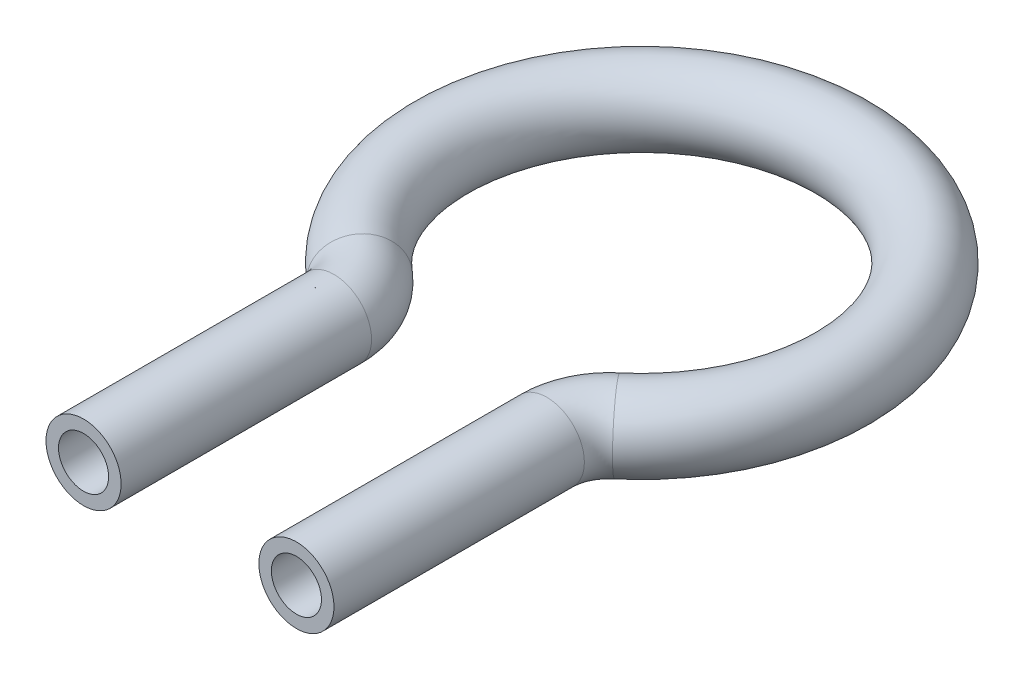
ISO-10303-21;
HEADER;
FILE_DESCRIPTION(('STEP AP214'),'2;1');
FILE_NAME('part.step','',(''),(''),'','','');
FILE_SCHEMA(('AUTOMOTIVE_DESIGN { 1 0 10303 214 1 1 1 1 }'));
ENDSEC;
DATA;
#1=APPLICATION_CONTEXT('core data for automotive mechanical design processes');
#2=APPLICATION_PROTOCOL_DEFINITION('international standard','automotive_design',2000,#1);
#3=PRODUCT_CONTEXT('',#1,'mechanical');
#4=PRODUCT('Part','Part','',(#3));
#5=PRODUCT_RELATED_PRODUCT_CATEGORY('part','',(#4));
#6=PRODUCT_DEFINITION_FORMATION('','',#4);
#7=PRODUCT_DEFINITION_CONTEXT('part definition',#1,'design');
#8=PRODUCT_DEFINITION('design','',#6,#7);
#9=PRODUCT_DEFINITION_SHAPE('','',#8);
#10=(LENGTH_UNIT() NAMED_UNIT(*) SI_UNIT(.MILLI.,.METRE.));
#11=(NAMED_UNIT(*) PLANE_ANGLE_UNIT() SI_UNIT($,.RADIAN.));
#12=(NAMED_UNIT(*) SI_UNIT($,.STERADIAN.) SOLID_ANGLE_UNIT());
#13=UNCERTAINTY_MEASURE_WITH_UNIT(LENGTH_MEASURE(1.E-05),#10,'distance_accuracy_value','');
#14=(GEOMETRIC_REPRESENTATION_CONTEXT(3) GLOBAL_UNCERTAINTY_ASSIGNED_CONTEXT((#13)) GLOBAL_UNIT_ASSIGNED_CONTEXT((#10,
#11,#12)) REPRESENTATION_CONTEXT('',''));
#15=CARTESIAN_POINT('',(0.,0.,0.));
#16=DIRECTION('',(0.,0.,1.));
#17=DIRECTION('',(1.,0.,0.));
#18=AXIS2_PLACEMENT_3D('',#15,#16,#17);
#19=CARTESIAN_POINT('',(-8.5,0.,36.0857079421454));
#20=DIRECTION('',(0.,0.,-1.));
#21=DIRECTION('',(-1.,0.,0.));
#22=AXIS2_PLACEMENT_3D('',#19,#20,#21);
#23=CYLINDRICAL_SURFACE('',#22,3.);
#24=CARTESIAN_POINT('',(-8.5,0.,16.0857079421454));
#25=DIRECTION('',(0.,0.,-1.));
#26=DIRECTION('',(-1.,0.,0.));
#27=AXIS2_PLACEMENT_3D('',#24,#25,#26);
#28=CIRCLE('',#27,3.);
#29=CARTESIAN_POINT('',(-5.5,0.,16.0857079421454));
#30=VERTEX_POINT('',#29);
#31=EDGE_CURVE('E65',#30,#30,#28,.T.);
#32=ORIENTED_EDGE('',*,*,#31,.F.);
#33=EDGE_LOOP('',(#32));
#34=FACE_BOUND('',#33,.T.);
#35=CARTESIAN_POINT('',(-8.5,0.,36.0857079421454));
#36=DIRECTION('',(0.,0.,-1.));
#37=DIRECTION('',(-1.,0.,0.));
#38=AXIS2_PLACEMENT_3D('',#35,#36,#37);
#39=CIRCLE('',#38,3.);
#40=CARTESIAN_POINT('',(-11.5,0.,36.0857079421454));
#41=VERTEX_POINT('',#40);
#42=EDGE_CURVE('E61',#41,#41,#39,.T.);
#43=ORIENTED_EDGE('',*,*,#42,.T.);
#44=EDGE_LOOP('',(#43));
#45=FACE_BOUND('',#44,.T.);
#46=ADVANCED_FACE('F37',(#34,#45),#23,.T.);
#47=CARTESIAN_POINT('',(-13.5,0.,16.0857079421454));
#48=DIRECTION('',(0.,1.,0.));
#49=DIRECTION('',(0.,0.,1.));
#50=AXIS2_PLACEMENT_3D('',#47,#48,#49);
#51=TOROIDAL_SURFACE('',#50,5.,3.);
#52=CARTESIAN_POINT('',(-10.2857142857143,0.,12.2557774797298));
#53=DIRECTION('',(-0.765986092483114,0.,-0.642857142857144));
#54=DIRECTION('',(-0.642857142857144,0.,0.765986092483114));
#55=AXIS2_PLACEMENT_3D('',#52,#53,#54);
#56=CIRCLE('',#55,3.);
#57=CARTESIAN_POINT('',(-8.35714285714285,0.,9.9578192022805));
#58=VERTEX_POINT('',#57);
#59=EDGE_CURVE('E69',#58,#58,#56,.T.);
#60=CARTESIAN_POINT('',(-13.5,0.,16.0857079421454));
#61=DIRECTION('',(0.,1.,0.));
#62=DIRECTION('',(0.,0.,1.));
#63=AXIS2_PLACEMENT_3D('',#60,#61,#62);
#64=CIRCLE('',#63,8.);
#65=EDGE_CURVE('',#30,#58,#64,.T.);
#66=ORIENTED_EDGE('',*,*,#31,.T.);
#67=ORIENTED_EDGE('',*,*,#59,.F.);
#68=ORIENTED_EDGE('',*,*,#65,.T.);
#69=ORIENTED_EDGE('',*,*,#65,.F.);
#70=EDGE_LOOP('',(#66,#68,#67,#69));
#71=FACE_BOUND('',#70,.T.);
#72=ADVANCED_FACE('F91',(#71),#51,.T.);
#73=CARTESIAN_POINT('',(0.,0.,0.));
#74=DIRECTION('',(0.,-1.,0.));
#75=DIRECTION('',(0.,0.,-1.));
#76=AXIS2_PLACEMENT_3D('',#73,#74,#75);
#77=TOROIDAL_SURFACE('',#76,16.,3.);
#78=CARTESIAN_POINT('',(10.2857142857143,0.,12.2557774797298));
#79=DIRECTION('',(-0.765986092483115,0.,0.642857142857142));
#80=DIRECTION('',(0.642857142857143,0.,0.765986092483115));
#81=AXIS2_PLACEMENT_3D('',#78,#79,#80);
#82=CIRCLE('',#81,3.);
#83=CARTESIAN_POINT('',(8.35714285714285,0.,9.9578192022805));
#84=VERTEX_POINT('',#83);
#85=EDGE_CURVE('E72',#84,#84,#82,.T.);
#86=ORIENTED_EDGE('',*,*,#85,.F.);
#87=EDGE_LOOP('',(#86));
#88=FACE_BOUND('',#87,.T.);
#89=ORIENTED_EDGE('',*,*,#59,.T.);
#90=EDGE_LOOP('',(#89));
#91=FACE_BOUND('',#90,.T.);
#92=ADVANCED_FACE('F84',(#88,#91),#77,.T.);
#93=CARTESIAN_POINT('',(13.5,0.,16.0857079421454));
#94=DIRECTION('',(0.,1.,0.));
#95=DIRECTION('',(0.,0.,1.));
#96=AXIS2_PLACEMENT_3D('',#93,#94,#95);
#97=TOROIDAL_SURFACE('',#96,5.,3.);
#98=CARTESIAN_POINT('',(8.5,0.,16.0857079421454));
#99=DIRECTION('',(0.,0.,1.));
#100=DIRECTION('',(1.,0.,0.));
#101=AXIS2_PLACEMENT_3D('',#98,#99,#100);
#102=CIRCLE('',#101,3.);
#103=CARTESIAN_POINT('',(5.5,0.,16.0857079421454));
#104=VERTEX_POINT('',#103);
#105=EDGE_CURVE('E41',#104,#104,#102,.T.);
#106=CARTESIAN_POINT('',(13.5,0.,16.0857079421454));
#107=DIRECTION('',(0.,1.,0.));
#108=DIRECTION('',(0.,0.,1.));
#109=AXIS2_PLACEMENT_3D('',#106,#107,#108);
#110=CIRCLE('',#109,8.);
#111=EDGE_CURVE('',#84,#104,#110,.T.);
#112=ORIENTED_EDGE('',*,*,#85,.T.);
#113=ORIENTED_EDGE('',*,*,#105,.F.);
#114=ORIENTED_EDGE('',*,*,#111,.T.);
#115=ORIENTED_EDGE('',*,*,#111,.F.);
#116=EDGE_LOOP('',(#112,#114,#113,#115));
#117=FACE_BOUND('',#116,.T.);
#118=ADVANCED_FACE('F82',(#117),#97,.T.);
#119=CARTESIAN_POINT('',(8.5,0.,16.0857079421454));
#120=DIRECTION('',(0.,0.,1.));
#121=DIRECTION('',(1.,0.,0.));
#122=AXIS2_PLACEMENT_3D('',#119,#120,#121);
#123=CYLINDRICAL_SURFACE('',#122,3.);
#124=CARTESIAN_POINT('',(8.5,0.,36.0857079421454));
#125=DIRECTION('',(0.,0.,1.));
#126=DIRECTION('',(1.,0.,0.));
#127=AXIS2_PLACEMENT_3D('',#124,#125,#126);
#128=CIRCLE('',#127,3.);
#129=CARTESIAN_POINT('',(11.5,0.,36.0857079421454));
#130=VERTEX_POINT('',#129);
#131=EDGE_CURVE('E56',#130,#130,#128,.T.);
#132=ORIENTED_EDGE('',*,*,#131,.F.);
#133=EDGE_LOOP('',(#132));
#134=FACE_BOUND('',#133,.T.);
#135=ORIENTED_EDGE('',*,*,#105,.T.);
#136=EDGE_LOOP('',(#135));
#137=FACE_BOUND('',#136,.T.);
#138=ADVANCED_FACE('F39',(#134,#137),#123,.T.);
#139=CARTESIAN_POINT('',(-8.5,0.,36.0857079421454));
#140=DIRECTION('',(0.,0.,-1.));
#141=DIRECTION('',(-1.,0.,0.));
#142=AXIS2_PLACEMENT_3D('',#139,#140,#141);
#143=PLANE('',#142);
#144=CARTESIAN_POINT('',(-8.5,0.,36.0857079421454));
#145=DIRECTION('',(0.,0.,-1.));
#146=DIRECTION('',(-1.,0.,0.));
#147=AXIS2_PLACEMENT_3D('',#144,#145,#146);
#148=CIRCLE('',#147,2.);
#149=CARTESIAN_POINT('',(-10.5,0.,36.0857079421454));
#150=VERTEX_POINT('',#149);
#151=EDGE_CURVE('E60',#150,#150,#148,.F.);
#152=ORIENTED_EDGE('',*,*,#151,.F.);
#153=EDGE_LOOP('',(#152));
#154=FACE_BOUND('',#153,.T.);
#155=ORIENTED_EDGE('',*,*,#42,.F.);
#156=EDGE_LOOP('',(#155));
#157=FACE_BOUND('',#156,.T.);
#158=ADVANCED_FACE('F89',(#154,#157),#143,.F.);
#159=CARTESIAN_POINT('',(8.5,0.,36.0857079421454));
#160=DIRECTION('',(0.,0.,1.));
#161=DIRECTION('',(1.,0.,0.));
#162=AXIS2_PLACEMENT_3D('',#159,#160,#161);
#163=PLANE('',#162);
#164=CARTESIAN_POINT('',(8.5,0.,36.0857079421454));
#165=DIRECTION('',(0.,0.,1.));
#166=DIRECTION('',(1.,0.,0.));
#167=AXIS2_PLACEMENT_3D('',#164,#165,#166);
#168=CIRCLE('',#167,2.);
#169=CARTESIAN_POINT('',(10.5,0.,36.0857079421454));
#170=VERTEX_POINT('',#169);
#171=EDGE_CURVE('E10',#170,#170,#168,.F.);
#172=ORIENTED_EDGE('',*,*,#171,.T.);
#173=EDGE_LOOP('',(#172));
#174=FACE_BOUND('',#173,.T.);
#175=ORIENTED_EDGE('',*,*,#131,.T.);
#176=EDGE_LOOP('',(#175));
#177=FACE_BOUND('',#176,.T.);
#178=ADVANCED_FACE('F108',(#174,#177),#163,.T.);
#179=CARTESIAN_POINT('',(-8.5,0.,36.0857079421454));
#180=DIRECTION('',(0.,0.,-1.));
#181=DIRECTION('',(-1.,0.,0.));
#182=AXIS2_PLACEMENT_3D('',#179,#180,#181);
#183=CYLINDRICAL_SURFACE('',#182,2.);
#184=CARTESIAN_POINT('',(-8.5,0.,16.0857079421454));
#185=DIRECTION('',(0.,0.,-1.));
#186=DIRECTION('',(-1.,0.,0.));
#187=AXIS2_PLACEMENT_3D('',#184,#185,#186);
#188=CIRCLE('',#187,2.);
#189=CARTESIAN_POINT('',(-6.5,0.,16.0857079421454));
#190=VERTEX_POINT('',#189);
#191=EDGE_CURVE('E205',#190,#190,#188,.F.);
#192=ORIENTED_EDGE('',*,*,#191,.F.);
#193=EDGE_LOOP('',(#192));
#194=FACE_BOUND('',#193,.T.);
#195=ORIENTED_EDGE('',*,*,#151,.T.);
#196=EDGE_LOOP('',(#195));
#197=FACE_BOUND('',#196,.T.);
#198=ADVANCED_FACE('F111',(#194,#197),#183,.F.);
#199=CARTESIAN_POINT('',(-13.5,0.,16.0857079421454));
#200=DIRECTION('',(0.,1.,0.));
#201=DIRECTION('',(0.,0.,1.));
#202=AXIS2_PLACEMENT_3D('',#199,#200,#201);
#203=TOROIDAL_SURFACE('',#202,5.,2.);
#204=CARTESIAN_POINT('',(-10.2857142857143,0.,12.2557774797298));
#205=DIRECTION('',(-0.765986092483114,0.,-0.642857142857144));
#206=DIRECTION('',(-0.642857142857144,0.,0.765986092483114));
#207=AXIS2_PLACEMENT_3D('',#204,#205,#206);
#208=CIRCLE('',#207,2.);
#209=CARTESIAN_POINT('',(-8.99999999999999,0.,10.7238052947636));
#210=VERTEX_POINT('',#209);
#211=EDGE_CURVE('E203',#210,#210,#208,.F.);
#212=CARTESIAN_POINT('',(-13.5,0.,16.0857079421454));
#213=DIRECTION('',(0.,1.,0.));
#214=DIRECTION('',(0.,0.,1.));
#215=AXIS2_PLACEMENT_3D('',#212,#213,#214);
#216=CIRCLE('',#215,7.);
#217=EDGE_CURVE('',#190,#210,#216,.T.);
#218=ORIENTED_EDGE('',*,*,#191,.T.);
#219=ORIENTED_EDGE('',*,*,#211,.F.);
#220=ORIENTED_EDGE('',*,*,#217,.T.);
#221=ORIENTED_EDGE('',*,*,#217,.F.);
#222=EDGE_LOOP('',(#218,#220,#219,#221));
#223=FACE_BOUND('',#222,.T.);
#224=ADVANCED_FACE('F166',(#223),#203,.F.);
#225=CARTESIAN_POINT('',(0.,0.,0.));
#226=DIRECTION('',(0.,-1.,0.));
#227=DIRECTION('',(0.,0.,-1.));
#228=AXIS2_PLACEMENT_3D('',#225,#226,#227);
#229=TOROIDAL_SURFACE('',#228,16.,2.);
#230=CARTESIAN_POINT('',(10.2857142857143,0.,12.2557774797298));
#231=DIRECTION('',(-0.765986092483115,0.,0.642857142857142));
#232=DIRECTION('',(0.642857142857143,0.,0.765986092483115));
#233=AXIS2_PLACEMENT_3D('',#230,#231,#232);
#234=CIRCLE('',#233,2.);
#235=CARTESIAN_POINT('',(8.99999999999999,0.,10.7238052947636));
#236=VERTEX_POINT('',#235);
#237=EDGE_CURVE('E52',#236,#236,#234,.F.);
#238=ORIENTED_EDGE('',*,*,#237,.F.);
#239=EDGE_LOOP('',(#238));
#240=FACE_BOUND('',#239,.T.);
#241=ORIENTED_EDGE('',*,*,#211,.T.);
#242=EDGE_LOOP('',(#241));
#243=FACE_BOUND('',#242,.T.);
#244=ADVANCED_FACE('F102',(#240,#243),#229,.F.);
#245=CARTESIAN_POINT('',(13.5,0.,16.0857079421454));
#246=DIRECTION('',(0.,1.,0.));
#247=DIRECTION('',(0.,0.,1.));
#248=AXIS2_PLACEMENT_3D('',#245,#246,#247);
#249=TOROIDAL_SURFACE('',#248,5.,2.);
#250=CARTESIAN_POINT('',(8.5,0.,16.0857079421454));
#251=DIRECTION('',(0.,0.,1.));
#252=DIRECTION('',(1.,0.,0.));
#253=AXIS2_PLACEMENT_3D('',#250,#251,#252);
#254=CIRCLE('',#253,2.);
#255=CARTESIAN_POINT('',(6.5,0.,16.0857079421454));
#256=VERTEX_POINT('',#255);
#257=EDGE_CURVE('E46',#256,#256,#254,.F.);
#258=CARTESIAN_POINT('',(13.5,0.,16.0857079421454));
#259=DIRECTION('',(0.,1.,0.));
#260=DIRECTION('',(0.,0.,1.));
#261=AXIS2_PLACEMENT_3D('',#258,#259,#260);
#262=CIRCLE('',#261,7.);
#263=EDGE_CURVE('',#236,#256,#262,.T.);
#264=ORIENTED_EDGE('',*,*,#237,.T.);
#265=ORIENTED_EDGE('',*,*,#257,.F.);
#266=ORIENTED_EDGE('',*,*,#263,.T.);
#267=ORIENTED_EDGE('',*,*,#263,.F.);
#268=EDGE_LOOP('',(#264,#266,#265,#267));
#269=FACE_BOUND('',#268,.T.);
#270=ADVANCED_FACE('F96',(#269),#249,.F.);
#271=CARTESIAN_POINT('',(8.5,0.,16.0857079421454));
#272=DIRECTION('',(0.,0.,1.));
#273=DIRECTION('',(1.,0.,0.));
#274=AXIS2_PLACEMENT_3D('',#271,#272,#273);
#275=CYLINDRICAL_SURFACE('',#274,2.);
#276=ORIENTED_EDGE('',*,*,#171,.F.);
#277=EDGE_LOOP('',(#276));
#278=FACE_BOUND('',#277,.T.);
#279=ORIENTED_EDGE('',*,*,#257,.T.);
#280=EDGE_LOOP('',(#279));
#281=FACE_BOUND('',#280,.T.);
#282=ADVANCED_FACE('F94',(#278,#281),#275,.F.);
#283=CLOSED_SHELL('',(#46,#72,#92,#118,#138,#158,#178,#198,#224,#244,#270,#282));
#284=MANIFOLD_SOLID_BREP('B2',#283);
#285=ADVANCED_BREP_SHAPE_REPRESENTATION('',(#18,#284),#14);
#286=SHAPE_DEFINITION_REPRESENTATION(#9,#285);
ENDSEC;
END-ISO-10303-21;
